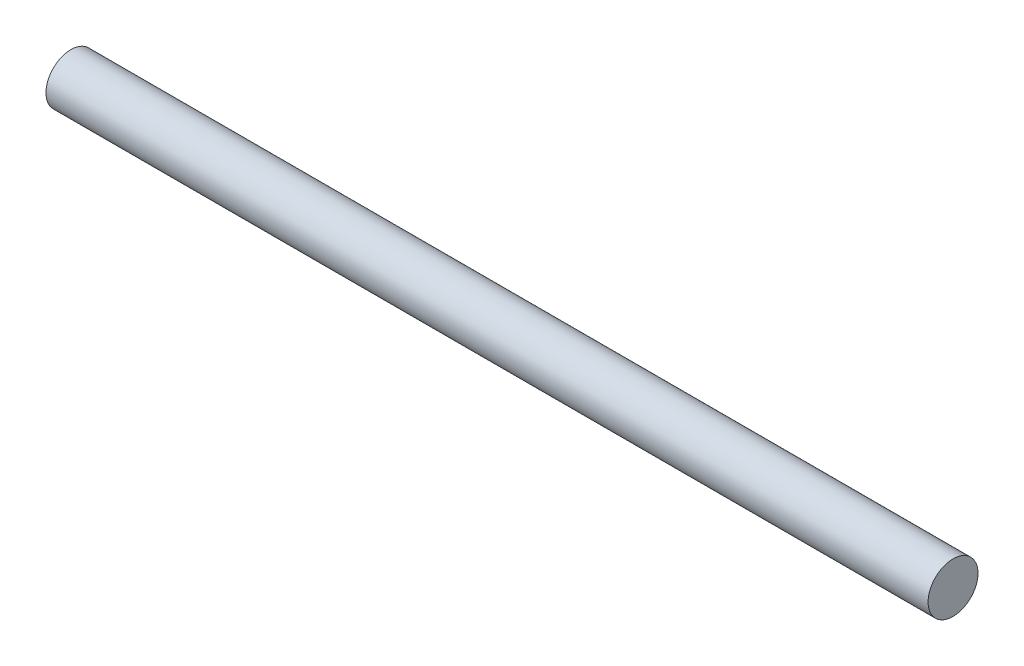
ISO-10303-21;
HEADER;
FILE_DESCRIPTION(('STEP AP214'),'2;1');
FILE_NAME('part.step','',(''),(''),'','','');
FILE_SCHEMA(('AUTOMOTIVE_DESIGN { 1 0 10303 214 1 1 1 1 }'));
ENDSEC;
DATA;
#1=APPLICATION_CONTEXT('core data for automotive mechanical design processes');
#2=APPLICATION_PROTOCOL_DEFINITION('international standard','automotive_design',2000,#1);
#3=PRODUCT_CONTEXT('',#1,'mechanical');
#4=PRODUCT('Part','Part','',(#3));
#5=PRODUCT_RELATED_PRODUCT_CATEGORY('part','',(#4));
#6=PRODUCT_DEFINITION_FORMATION('','',#4);
#7=PRODUCT_DEFINITION_CONTEXT('part definition',#1,'design');
#8=PRODUCT_DEFINITION('design','',#6,#7);
#9=PRODUCT_DEFINITION_SHAPE('','',#8);
#10=(LENGTH_UNIT() NAMED_UNIT(*) SI_UNIT(.MILLI.,.METRE.));
#11=(NAMED_UNIT(*) PLANE_ANGLE_UNIT() SI_UNIT($,.RADIAN.));
#12=(NAMED_UNIT(*) SI_UNIT($,.STERADIAN.) SOLID_ANGLE_UNIT());
#13=UNCERTAINTY_MEASURE_WITH_UNIT(LENGTH_MEASURE(1.E-05),#10,'distance_accuracy_value','');
#14=(GEOMETRIC_REPRESENTATION_CONTEXT(3) GLOBAL_UNCERTAINTY_ASSIGNED_CONTEXT((#13)) GLOBAL_UNIT_ASSIGNED_CONTEXT((#10,
#11,#12)) REPRESENTATION_CONTEXT('',''));
#15=CARTESIAN_POINT('',(0.,0.,0.));
#16=DIRECTION('',(0.,0.,1.));
#17=DIRECTION('',(1.,0.,0.));
#18=AXIS2_PLACEMENT_3D('',#15,#16,#17);
#19=CARTESIAN_POINT('',(212.,0.,0.));
#20=DIRECTION('',(-1.,0.,0.));
#21=DIRECTION('',(0.,0.,1.));
#22=AXIS2_PLACEMENT_3D('',#19,#20,#21);
#23=CYLINDRICAL_SURFACE('',#22,6.);
#24=CARTESIAN_POINT('',(212.,0.,0.));
#25=DIRECTION('',(1.,0.,0.));
#26=DIRECTION('',(0.,0.,-1.));
#27=AXIS2_PLACEMENT_3D('',#24,#25,#26);
#28=CIRCLE('',#27,6.);
#29=CARTESIAN_POINT('',(212.,0.,-6.));
#30=VERTEX_POINT('',#29);
#31=EDGE_CURVE('E10',#30,#30,#28,.T.);
#32=ORIENTED_EDGE('',*,*,#31,.F.);
#33=EDGE_LOOP('',(#32));
#34=FACE_BOUND('',#33,.T.);
#35=CARTESIAN_POINT('',(0.,0.,0.));
#36=DIRECTION('',(1.,0.,0.));
#37=DIRECTION('',(0.,0.,-1.));
#38=AXIS2_PLACEMENT_3D('',#35,#36,#37);
#39=CIRCLE('',#38,6.);
#40=CARTESIAN_POINT('',(0.,0.,-6.));
#41=VERTEX_POINT('',#40);
#42=EDGE_CURVE('E34',#41,#41,#39,.T.);
#43=ORIENTED_EDGE('',*,*,#42,.T.);
#44=EDGE_LOOP('',(#43));
#45=FACE_BOUND('',#44,.T.);
#46=ADVANCED_FACE('F31',(#34,#45),#23,.T.);
#47=CARTESIAN_POINT('',(212.,0.,0.));
#48=DIRECTION('',(1.,0.,0.));
#49=DIRECTION('',(0.,0.,-1.));
#50=AXIS2_PLACEMENT_3D('',#47,#48,#49);
#51=PLANE('',#50);
#52=ORIENTED_EDGE('',*,*,#31,.T.);
#53=EDGE_LOOP('',(#52));
#54=FACE_BOUND('',#53,.T.);
#55=ADVANCED_FACE('F46',(#54),#51,.T.);
#56=CARTESIAN_POINT('',(0.,0.,0.));
#57=DIRECTION('',(1.,0.,0.));
#58=DIRECTION('',(0.,0.,-1.));
#59=AXIS2_PLACEMENT_3D('',#56,#57,#58);
#60=PLANE('',#59);
#61=ORIENTED_EDGE('',*,*,#42,.F.);
#62=EDGE_LOOP('',(#61));
#63=FACE_BOUND('',#62,.T.);
#64=ADVANCED_FACE('F44',(#63),#60,.F.);
#65=CLOSED_SHELL('',(#46,#55,#64));
#66=MANIFOLD_SOLID_BREP('B2',#65);
#67=ADVANCED_BREP_SHAPE_REPRESENTATION('',(#18,#66),#14);
#68=SHAPE_DEFINITION_REPRESENTATION(#9,#67);
ENDSEC;
END-ISO-10303-21;
